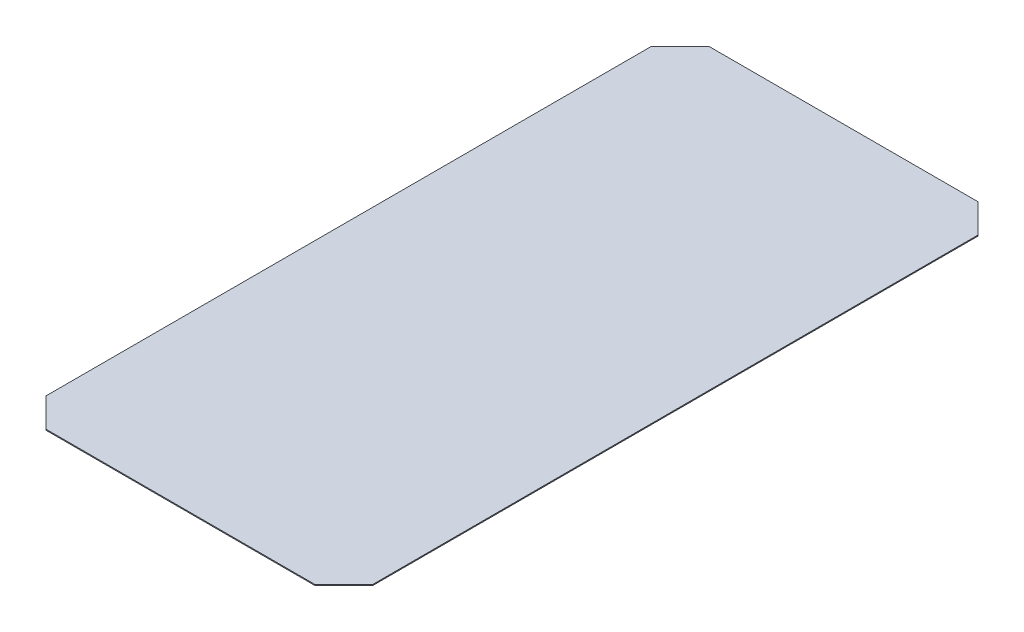
ISO-10303-21;
HEADER;
FILE_DESCRIPTION(('STEP AP214'),'2;1');
FILE_NAME('part.step','',(''),(''),'','','');
FILE_SCHEMA(('AUTOMOTIVE_DESIGN { 1 0 10303 214 1 1 1 1 }'));
ENDSEC;
DATA;
#1=APPLICATION_CONTEXT('core data for automotive mechanical design processes');
#2=APPLICATION_PROTOCOL_DEFINITION('international standard','automotive_design',2000,#1);
#3=PRODUCT_CONTEXT('',#1,'mechanical');
#4=PRODUCT('Part','Part','',(#3));
#5=PRODUCT_RELATED_PRODUCT_CATEGORY('part','',(#4));
#6=PRODUCT_DEFINITION_FORMATION('','',#4);
#7=PRODUCT_DEFINITION_CONTEXT('part definition',#1,'design');
#8=PRODUCT_DEFINITION('design','',#6,#7);
#9=PRODUCT_DEFINITION_SHAPE('','',#8);
#10=(LENGTH_UNIT() NAMED_UNIT(*) SI_UNIT(.MILLI.,.METRE.));
#11=(NAMED_UNIT(*) PLANE_ANGLE_UNIT() SI_UNIT($,.RADIAN.));
#12=(NAMED_UNIT(*) SI_UNIT($,.STERADIAN.) SOLID_ANGLE_UNIT());
#13=UNCERTAINTY_MEASURE_WITH_UNIT(LENGTH_MEASURE(1.E-05),#10,'distance_accuracy_value','');
#14=(GEOMETRIC_REPRESENTATION_CONTEXT(3) GLOBAL_UNCERTAINTY_ASSIGNED_CONTEXT((#13)) GLOBAL_UNIT_ASSIGNED_CONTEXT((#10,
#11,#12)) REPRESENTATION_CONTEXT('',''));
#15=CARTESIAN_POINT('',(0.,0.,0.));
#16=DIRECTION('',(0.,0.,1.));
#17=DIRECTION('',(1.,0.,0.));
#18=AXIS2_PLACEMENT_3D('',#15,#16,#17);
#19=CARTESIAN_POINT('',(-24.1,0.1,-40.));
#20=DIRECTION('',(0.,0.,1.));
#21=DIRECTION('',(1.,0.,0.));
#22=AXIS2_PLACEMENT_3D('',#19,#20,#21);
#23=PLANE('',#22);
#24=DIRECTION('',(-1.,0.,0.));
#25=VECTOR('',#24,1.);
#26=CARTESIAN_POINT('',(-24.1,0.1,-40.));
#27=LINE('',#26,#25);
#28=CARTESIAN_POINT('',(6.89999999999998,0.1,-40.));
#29=VERTEX_POINT('',#28);
#30=CARTESIAN_POINT('',(-21.1,0.1,-40.));
#31=VERTEX_POINT('',#30);
#32=EDGE_CURVE('E143',#29,#31,#27,.T.);
#33=ORIENTED_EDGE('',*,*,#32,.F.);
#34=DIRECTION('',(0.,-1.,0.));
#35=VECTOR('',#34,1.);
#36=CARTESIAN_POINT('',(6.89999999999998,0.1,-40.));
#37=LINE('',#36,#35);
#38=CARTESIAN_POINT('',(6.89999999999998,0.,-40.));
#39=VERTEX_POINT('',#38);
#40=EDGE_CURVE('E113',#29,#39,#37,.T.);
#41=ORIENTED_EDGE('',*,*,#40,.T.);
#42=DIRECTION('',(-1.,0.,0.));
#43=VECTOR('',#42,1.);
#44=CARTESIAN_POINT('',(-24.1,0.,-40.));
#45=LINE('',#44,#43);
#46=CARTESIAN_POINT('',(-21.1,0.,-40.));
#47=VERTEX_POINT('',#46);
#48=EDGE_CURVE('E149',#39,#47,#45,.T.);
#49=ORIENTED_EDGE('',*,*,#48,.T.);
#50=DIRECTION('',(0.,1.,0.));
#51=VECTOR('',#50,1.);
#52=CARTESIAN_POINT('',(-21.1,0.1,-40.));
#53=LINE('',#52,#51);
#54=EDGE_CURVE('E118',#47,#31,#53,.T.);
#55=ORIENTED_EDGE('',*,*,#54,.T.);
#56=EDGE_LOOP('',(#33,#41,#49,#55));
#57=FACE_BOUND('',#56,.T.);
#58=ADVANCED_FACE('F39',(#57),#23,.F.);
#59=CARTESIAN_POINT('',(-24.1,0.1,40.));
#60=DIRECTION('',(1.,0.,0.));
#61=DIRECTION('',(0.,0.,-1.));
#62=AXIS2_PLACEMENT_3D('',#59,#60,#61);
#63=PLANE('',#62);
#64=DIRECTION('',(0.,0.,1.));
#65=VECTOR('',#64,1.);
#66=CARTESIAN_POINT('',(-24.1,0.1,40.));
#67=LINE('',#66,#65);
#68=CARTESIAN_POINT('',(-24.1,0.1,-37.));
#69=VERTEX_POINT('',#68);
#70=CARTESIAN_POINT('',(-24.1,0.1,26.));
#71=VERTEX_POINT('',#70);
#72=EDGE_CURVE('E145',#69,#71,#67,.T.);
#73=ORIENTED_EDGE('',*,*,#72,.F.);
#74=DIRECTION('',(0.,-1.,0.));
#75=VECTOR('',#74,1.);
#76=CARTESIAN_POINT('',(-24.1,0.1,-37.));
#77=LINE('',#76,#75);
#78=CARTESIAN_POINT('',(-24.1,0.,-37.));
#79=VERTEX_POINT('',#78);
#80=EDGE_CURVE('E168',#69,#79,#77,.T.);
#81=ORIENTED_EDGE('',*,*,#80,.T.);
#82=DIRECTION('',(0.,0.,1.));
#83=VECTOR('',#82,1.);
#84=CARTESIAN_POINT('',(-24.1,0.,40.));
#85=LINE('',#84,#83);
#86=CARTESIAN_POINT('',(-24.1,0.,26.));
#87=VERTEX_POINT('',#86);
#88=EDGE_CURVE('E146',#79,#87,#85,.T.);
#89=ORIENTED_EDGE('',*,*,#88,.T.);
#90=DIRECTION('',(0.,1.,0.));
#91=VECTOR('',#90,1.);
#92=CARTESIAN_POINT('',(-24.1,0.1,26.));
#93=LINE('',#92,#91);
#94=EDGE_CURVE('E165',#87,#71,#93,.T.);
#95=ORIENTED_EDGE('',*,*,#94,.T.);
#96=EDGE_LOOP('',(#73,#81,#89,#95));
#97=FACE_BOUND('',#96,.T.);
#98=ADVANCED_FACE('F181',(#97),#63,.F.);
#99=CARTESIAN_POINT('',(0.,0.1,0.));
#100=DIRECTION('',(0.,-1.,0.));
#101=DIRECTION('',(0.,0.,-1.));
#102=AXIS2_PLACEMENT_3D('',#99,#100,#101);
#103=PLANE('',#102);
#104=DIRECTION('',(0.,0.,1.));
#105=VECTOR('',#104,1.);
#106=CARTESIAN_POINT('',(9.9,0.1,-40.));
#107=LINE('',#106,#105);
#108=CARTESIAN_POINT('',(9.9,0.1,-37.));
#109=VERTEX_POINT('',#108);
#110=CARTESIAN_POINT('',(9.90000000000001,0.1,26.));
#111=VERTEX_POINT('',#110);
#112=EDGE_CURVE('E125',#109,#111,#107,.T.);
#113=ORIENTED_EDGE('',*,*,#112,.F.);
#114=DIRECTION('',(0.707106781186549,0.,0.707106781186546));
#115=VECTOR('',#114,1.);
#116=CARTESIAN_POINT('',(9.9,0.1,-37.));
#117=LINE('',#116,#115);
#118=EDGE_CURVE('E108',#109,#29,#117,.F.);
#119=ORIENTED_EDGE('',*,*,#118,.T.);
#120=ORIENTED_EDGE('',*,*,#32,.T.);
#121=DIRECTION('',(0.707106781186549,0.,-0.707106781186546));
#122=VECTOR('',#121,1.);
#123=CARTESIAN_POINT('',(-24.1,0.1,-37.));
#124=LINE('',#123,#122);
#125=EDGE_CURVE('E119',#31,#69,#124,.F.);
#126=ORIENTED_EDGE('',*,*,#125,.T.);
#127=ORIENTED_EDGE('',*,*,#72,.T.);
#128=DIRECTION('',(-0.707106781186549,0.,-0.707106781186546));
#129=VECTOR('',#128,1.);
#130=CARTESIAN_POINT('',(-24.1,0.1,26.));
#131=LINE('',#130,#129);
#132=CARTESIAN_POINT('',(-21.1,0.1,29.));
#133=VERTEX_POINT('',#132);
#134=EDGE_CURVE('E129',#71,#133,#131,.F.);
#135=ORIENTED_EDGE('',*,*,#134,.T.);
#136=DIRECTION('',(-1.,0.,0.));
#137=VECTOR('',#136,1.);
#138=CARTESIAN_POINT('',(-24.1,0.1,29.));
#139=LINE('',#138,#137);
#140=CARTESIAN_POINT('',(6.90000000000001,0.1,29.));
#141=VERTEX_POINT('',#140);
#142=EDGE_CURVE('E135',#141,#133,#139,.T.);
#143=ORIENTED_EDGE('',*,*,#142,.F.);
#144=DIRECTION('',(-0.707106781186547,0.,0.707106781186548));
#145=VECTOR('',#144,1.);
#146=CARTESIAN_POINT('',(6.90000000000001,0.1,29.));
#147=LINE('',#146,#145);
#148=EDGE_CURVE('E134',#141,#111,#147,.F.);
#149=ORIENTED_EDGE('',*,*,#148,.T.);
#150=EDGE_LOOP('',(#113,#119,#120,#126,#127,#135,#143,#149));
#151=FACE_BOUND('',#150,.T.);
#152=ADVANCED_FACE('F132',(#151),#103,.F.);
#153=CARTESIAN_POINT('',(0.,0.,0.));
#154=DIRECTION('',(0.,-1.,0.));
#155=DIRECTION('',(0.,0.,-1.));
#156=AXIS2_PLACEMENT_3D('',#153,#154,#155);
#157=PLANE('',#156);
#158=ORIENTED_EDGE('',*,*,#48,.F.);
#159=DIRECTION('',(-0.707106781186549,0.,-0.707106781186546));
#160=VECTOR('',#159,1.);
#161=CARTESIAN_POINT('',(23.45,0.,-23.4500000000001));
#162=LINE('',#161,#160);
#163=CARTESIAN_POINT('',(9.9,0.,-37.));
#164=VERTEX_POINT('',#163);
#165=EDGE_CURVE('E163',#39,#164,#162,.F.);
#166=ORIENTED_EDGE('',*,*,#165,.T.);
#167=DIRECTION('',(0.,0.,1.));
#168=VECTOR('',#167,1.);
#169=CARTESIAN_POINT('',(9.9,0.,-40.));
#170=LINE('',#169,#168);
#171=CARTESIAN_POINT('',(9.90000000000001,0.,26.));
#172=VERTEX_POINT('',#171);
#173=EDGE_CURVE('E128',#164,#172,#170,.T.);
#174=ORIENTED_EDGE('',*,*,#173,.T.);
#175=DIRECTION('',(0.707106781186547,0.,-0.707106781186548));
#176=VECTOR('',#175,1.);
#177=CARTESIAN_POINT('',(17.95,0.,17.95));
#178=LINE('',#177,#176);
#179=CARTESIAN_POINT('',(6.90000000000001,0.,29.));
#180=VERTEX_POINT('',#179);
#181=EDGE_CURVE('E160',#172,#180,#178,.F.);
#182=ORIENTED_EDGE('',*,*,#181,.T.);
#183=DIRECTION('',(-1.,0.,0.));
#184=VECTOR('',#183,1.);
#185=CARTESIAN_POINT('',(-24.1,0.,29.));
#186=LINE('',#185,#184);
#187=CARTESIAN_POINT('',(-21.1,0.,29.));
#188=VERTEX_POINT('',#187);
#189=EDGE_CURVE('E140',#180,#188,#186,.T.);
#190=ORIENTED_EDGE('',*,*,#189,.T.);
#191=DIRECTION('',(0.707106781186549,0.,0.707106781186546));
#192=VECTOR('',#191,1.);
#193=CARTESIAN_POINT('',(-25.05,0.,25.0500000000001));
#194=LINE('',#193,#192);
#195=EDGE_CURVE('E55',#188,#87,#194,.F.);
#196=ORIENTED_EDGE('',*,*,#195,.T.);
#197=ORIENTED_EDGE('',*,*,#88,.F.);
#198=DIRECTION('',(-0.707106781186549,0.,0.707106781186546));
#199=VECTOR('',#198,1.);
#200=CARTESIAN_POINT('',(-30.5499999999999,0.,-30.5500000000001));
#201=LINE('',#200,#199);
#202=EDGE_CURVE('E63',#79,#47,#201,.F.);
#203=ORIENTED_EDGE('',*,*,#202,.T.);
#204=EDGE_LOOP('',(#158,#166,#174,#182,#190,#196,#197,#203));
#205=FACE_BOUND('',#204,.T.);
#206=ADVANCED_FACE('F176',(#205),#157,.T.);
#207=CARTESIAN_POINT('',(9.9,0.,-40.));
#208=DIRECTION('',(-1.,0.,0.));
#209=DIRECTION('',(0.,0.,1.));
#210=AXIS2_PLACEMENT_3D('',#207,#208,#209);
#211=PLANE('',#210);
#212=ORIENTED_EDGE('',*,*,#173,.F.);
#213=DIRECTION('',(0.,1.,0.));
#214=VECTOR('',#213,1.);
#215=CARTESIAN_POINT('',(9.9,0.,-37.));
#216=LINE('',#215,#214);
#217=EDGE_CURVE('E112',#164,#109,#216,.T.);
#218=ORIENTED_EDGE('',*,*,#217,.T.);
#219=ORIENTED_EDGE('',*,*,#112,.T.);
#220=DIRECTION('',(0.,-1.,0.));
#221=VECTOR('',#220,1.);
#222=CARTESIAN_POINT('',(9.90000000000001,0.,26.));
#223=LINE('',#222,#221);
#224=EDGE_CURVE('E130',#111,#172,#223,.T.);
#225=ORIENTED_EDGE('',*,*,#224,.T.);
#226=EDGE_LOOP('',(#212,#218,#219,#225));
#227=FACE_BOUND('',#226,.T.);
#228=ADVANCED_FACE('F124',(#227),#211,.F.);
#229=CARTESIAN_POINT('',(-24.1,0.,29.));
#230=DIRECTION('',(0.,0.,-1.));
#231=DIRECTION('',(-1.,0.,0.));
#232=AXIS2_PLACEMENT_3D('',#229,#230,#231);
#233=PLANE('',#232);
#234=ORIENTED_EDGE('',*,*,#189,.F.);
#235=DIRECTION('',(0.,1.,0.));
#236=VECTOR('',#235,1.);
#237=CARTESIAN_POINT('',(6.90000000000001,0.,29.));
#238=LINE('',#237,#236);
#239=EDGE_CURVE('E11',#180,#141,#238,.T.);
#240=ORIENTED_EDGE('',*,*,#239,.T.);
#241=ORIENTED_EDGE('',*,*,#142,.T.);
#242=DIRECTION('',(0.,-1.,0.));
#243=VECTOR('',#242,1.);
#244=CARTESIAN_POINT('',(-21.1,0.,29.));
#245=LINE('',#244,#243);
#246=EDGE_CURVE('E48',#133,#188,#245,.T.);
#247=ORIENTED_EDGE('',*,*,#246,.T.);
#248=EDGE_LOOP('',(#234,#240,#241,#247));
#249=FACE_BOUND('',#248,.T.);
#250=ADVANCED_FACE('F172',(#249),#233,.F.);
#251=CARTESIAN_POINT('',(9.9,0.,-37.));
#252=DIRECTION('',(-0.707106781186546,0.,0.707106781186549));
#253=DIRECTION('',(0.,1.,0.));
#254=AXIS2_PLACEMENT_3D('',#251,#252,#253);
#255=PLANE('',#254);
#256=ORIENTED_EDGE('',*,*,#165,.F.);
#257=ORIENTED_EDGE('',*,*,#40,.F.);
#258=ORIENTED_EDGE('',*,*,#118,.F.);
#259=ORIENTED_EDGE('',*,*,#217,.F.);
#260=EDGE_LOOP('',(#256,#257,#258,#259));
#261=FACE_BOUND('',#260,.T.);
#262=ADVANCED_FACE('F111',(#261),#255,.F.);
#263=CARTESIAN_POINT('',(-24.1,0.1,-37.));
#264=DIRECTION('',(0.707106781186546,0.,0.707106781186549));
#265=DIRECTION('',(0.,-1.,0.));
#266=AXIS2_PLACEMENT_3D('',#263,#264,#265);
#267=PLANE('',#266);
#268=ORIENTED_EDGE('',*,*,#125,.F.);
#269=ORIENTED_EDGE('',*,*,#54,.F.);
#270=ORIENTED_EDGE('',*,*,#202,.F.);
#271=ORIENTED_EDGE('',*,*,#80,.F.);
#272=EDGE_LOOP('',(#268,#269,#270,#271));
#273=FACE_BOUND('',#272,.T.);
#274=ADVANCED_FACE('F183',(#273),#267,.F.);
#275=CARTESIAN_POINT('',(6.90000000000001,0.,29.));
#276=DIRECTION('',(-0.707106781186548,0.,-0.707106781186547));
#277=DIRECTION('',(0.,1.,0.));
#278=AXIS2_PLACEMENT_3D('',#275,#276,#277);
#279=PLANE('',#278);
#280=ORIENTED_EDGE('',*,*,#181,.F.);
#281=ORIENTED_EDGE('',*,*,#224,.F.);
#282=ORIENTED_EDGE('',*,*,#148,.F.);
#283=ORIENTED_EDGE('',*,*,#239,.F.);
#284=EDGE_LOOP('',(#280,#281,#282,#283));
#285=FACE_BOUND('',#284,.T.);
#286=ADVANCED_FACE('F203',(#285),#279,.F.);
#287=CARTESIAN_POINT('',(-24.1,0.1,26.));
#288=DIRECTION('',(0.707106781186546,0.,-0.707106781186549));
#289=DIRECTION('',(0.,1.,0.));
#290=AXIS2_PLACEMENT_3D('',#287,#288,#289);
#291=PLANE('',#290);
#292=ORIENTED_EDGE('',*,*,#195,.F.);
#293=ORIENTED_EDGE('',*,*,#246,.F.);
#294=ORIENTED_EDGE('',*,*,#134,.F.);
#295=ORIENTED_EDGE('',*,*,#94,.F.);
#296=EDGE_LOOP('',(#292,#293,#294,#295));
#297=FACE_BOUND('',#296,.T.);
#298=ADVANCED_FACE('F42',(#297),#291,.F.);
#299=CLOSED_SHELL('',(#58,#98,#152,#206,#228,#250,#262,#274,#286,#298));
#300=MANIFOLD_SOLID_BREP('B2',#299);
#301=ADVANCED_BREP_SHAPE_REPRESENTATION('',(#18,#300),#14);
#302=SHAPE_DEFINITION_REPRESENTATION(#9,#301);
ENDSEC;
END-ISO-10303-21;
